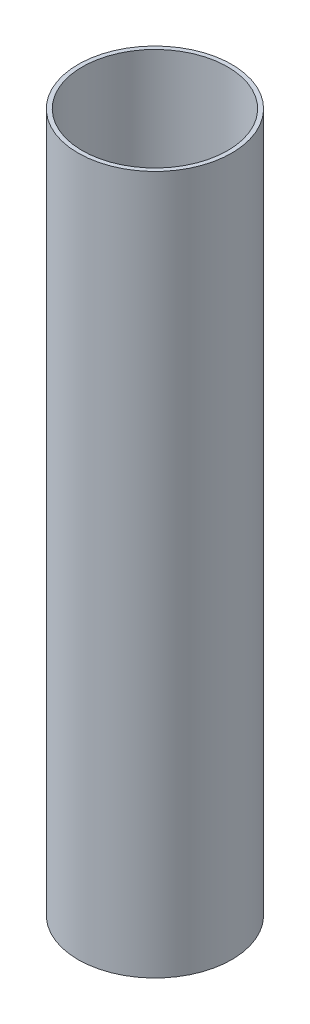
ISO-10303-21;
HEADER;
FILE_DESCRIPTION(('STEP AP214'),'2;1');
FILE_NAME('part.step','',(''),(''),'','','');
FILE_SCHEMA(('AUTOMOTIVE_DESIGN { 1 0 10303 214 1 1 1 1 }'));
ENDSEC;
DATA;
#1=APPLICATION_CONTEXT('core data for automotive mechanical design processes');
#2=APPLICATION_PROTOCOL_DEFINITION('international standard','automotive_design',2000,#1);
#3=PRODUCT_CONTEXT('',#1,'mechanical');
#4=PRODUCT('Part','Part','',(#3));
#5=PRODUCT_RELATED_PRODUCT_CATEGORY('part','',(#4));
#6=PRODUCT_DEFINITION_FORMATION('','',#4);
#7=PRODUCT_DEFINITION_CONTEXT('part definition',#1,'design');
#8=PRODUCT_DEFINITION('design','',#6,#7);
#9=PRODUCT_DEFINITION_SHAPE('','',#8);
#10=(LENGTH_UNIT() NAMED_UNIT(*) SI_UNIT(.MILLI.,.METRE.));
#11=(NAMED_UNIT(*) PLANE_ANGLE_UNIT() SI_UNIT($,.RADIAN.));
#12=(NAMED_UNIT(*) SI_UNIT($,.STERADIAN.) SOLID_ANGLE_UNIT());
#13=UNCERTAINTY_MEASURE_WITH_UNIT(LENGTH_MEASURE(1.E-05),#10,'distance_accuracy_value','');
#14=(GEOMETRIC_REPRESENTATION_CONTEXT(3) GLOBAL_UNCERTAINTY_ASSIGNED_CONTEXT((#13)) GLOBAL_UNIT_ASSIGNED_CONTEXT((#10,
#11,#12)) REPRESENTATION_CONTEXT('',''));
#15=CARTESIAN_POINT('',(0.,0.,0.));
#16=DIRECTION('',(0.,0.,1.));
#17=DIRECTION('',(1.,0.,0.));
#18=AXIS2_PLACEMENT_3D('',#15,#16,#17);
#19=CARTESIAN_POINT('',(0.,500.,0.));
#20=DIRECTION('',(0.,1.,0.));
#21=DIRECTION('',(0.,0.,1.));
#22=AXIS2_PLACEMENT_3D('',#19,#20,#21);
#23=PLANE('',#22);
#24=CARTESIAN_POINT('',(0.,500.,0.));
#25=DIRECTION('',(0.,1.,0.));
#26=DIRECTION('',(0.,0.,1.));
#27=AXIS2_PLACEMENT_3D('',#24,#25,#26);
#28=CIRCLE('',#27,55.);
#29=CARTESIAN_POINT('',(0.,500.,55.));
#30=VERTEX_POINT('',#29);
#31=EDGE_CURVE('E11',#30,#30,#28,.T.);
#32=ORIENTED_EDGE('',*,*,#31,.T.);
#33=EDGE_LOOP('',(#32));
#34=FACE_BOUND('',#33,.T.);
#35=CARTESIAN_POINT('',(0.,500.,0.));
#36=DIRECTION('',(0.,1.,0.));
#37=DIRECTION('',(1.,0.,0.));
#38=AXIS2_PLACEMENT_3D('',#35,#36,#37);
#39=CIRCLE('',#38,52.);
#40=CARTESIAN_POINT('',(52.,500.,0.));
#41=VERTEX_POINT('',#40);
#42=EDGE_CURVE('E49',#41,#41,#39,.T.);
#43=ORIENTED_EDGE('',*,*,#42,.F.);
#44=EDGE_LOOP('',(#43));
#45=FACE_BOUND('',#44,.T.);
#46=ADVANCED_FACE('F38',(#34,#45),#23,.T.);
#47=CARTESIAN_POINT('',(0.,0.,0.));
#48=DIRECTION('',(0.,1.,0.));
#49=DIRECTION('',(0.,0.,1.));
#50=AXIS2_PLACEMENT_3D('',#47,#48,#49);
#51=PLANE('',#50);
#52=CARTESIAN_POINT('',(0.,0.,0.));
#53=DIRECTION('',(0.,1.,0.));
#54=DIRECTION('',(0.,0.,1.));
#55=AXIS2_PLACEMENT_3D('',#52,#53,#54);
#56=CIRCLE('',#55,55.);
#57=CARTESIAN_POINT('',(0.,0.,55.));
#58=VERTEX_POINT('',#57);
#59=EDGE_CURVE('E42',#58,#58,#56,.T.);
#60=ORIENTED_EDGE('',*,*,#59,.F.);
#61=EDGE_LOOP('',(#60));
#62=FACE_BOUND('',#61,.T.);
#63=CARTESIAN_POINT('',(0.,0.,0.));
#64=DIRECTION('',(0.,1.,0.));
#65=DIRECTION('',(1.,0.,0.));
#66=AXIS2_PLACEMENT_3D('',#63,#64,#65);
#67=CIRCLE('',#66,52.);
#68=CARTESIAN_POINT('',(52.,0.,0.));
#69=VERTEX_POINT('',#68);
#70=EDGE_CURVE('E51',#69,#69,#67,.T.);
#71=ORIENTED_EDGE('',*,*,#70,.T.);
#72=EDGE_LOOP('',(#71));
#73=FACE_BOUND('',#72,.T.);
#74=ADVANCED_FACE('F61',(#62,#73),#51,.F.);
#75=CARTESIAN_POINT('',(0.,500.,0.));
#76=DIRECTION('',(0.,-1.,0.));
#77=DIRECTION('',(0.,0.,-1.));
#78=AXIS2_PLACEMENT_3D('',#75,#76,#77);
#79=CYLINDRICAL_SURFACE('',#78,55.);
#80=ORIENTED_EDGE('',*,*,#31,.F.);
#81=EDGE_LOOP('',(#80));
#82=FACE_BOUND('',#81,.T.);
#83=ORIENTED_EDGE('',*,*,#59,.T.);
#84=EDGE_LOOP('',(#83));
#85=FACE_BOUND('',#84,.T.);
#86=ADVANCED_FACE('F40',(#82,#85),#79,.T.);
#87=CARTESIAN_POINT('',(0.,500.,0.));
#88=DIRECTION('',(0.,-1.,0.));
#89=DIRECTION('',(0.,0.,-1.));
#90=AXIS2_PLACEMENT_3D('',#87,#88,#89);
#91=CYLINDRICAL_SURFACE('',#90,52.);
#92=ORIENTED_EDGE('',*,*,#42,.T.);
#93=EDGE_LOOP('',(#92));
#94=FACE_BOUND('',#93,.T.);
#95=ORIENTED_EDGE('',*,*,#70,.F.);
#96=EDGE_LOOP('',(#95));
#97=FACE_BOUND('',#96,.T.);
#98=ADVANCED_FACE('F57',(#94,#97),#91,.F.);
#99=CLOSED_SHELL('',(#46,#74,#86,#98));
#100=MANIFOLD_SOLID_BREP('B2',#99);
#101=ADVANCED_BREP_SHAPE_REPRESENTATION('',(#18,#100),#14);
#102=SHAPE_DEFINITION_REPRESENTATION(#9,#101);
ENDSEC;
END-ISO-10303-21;
